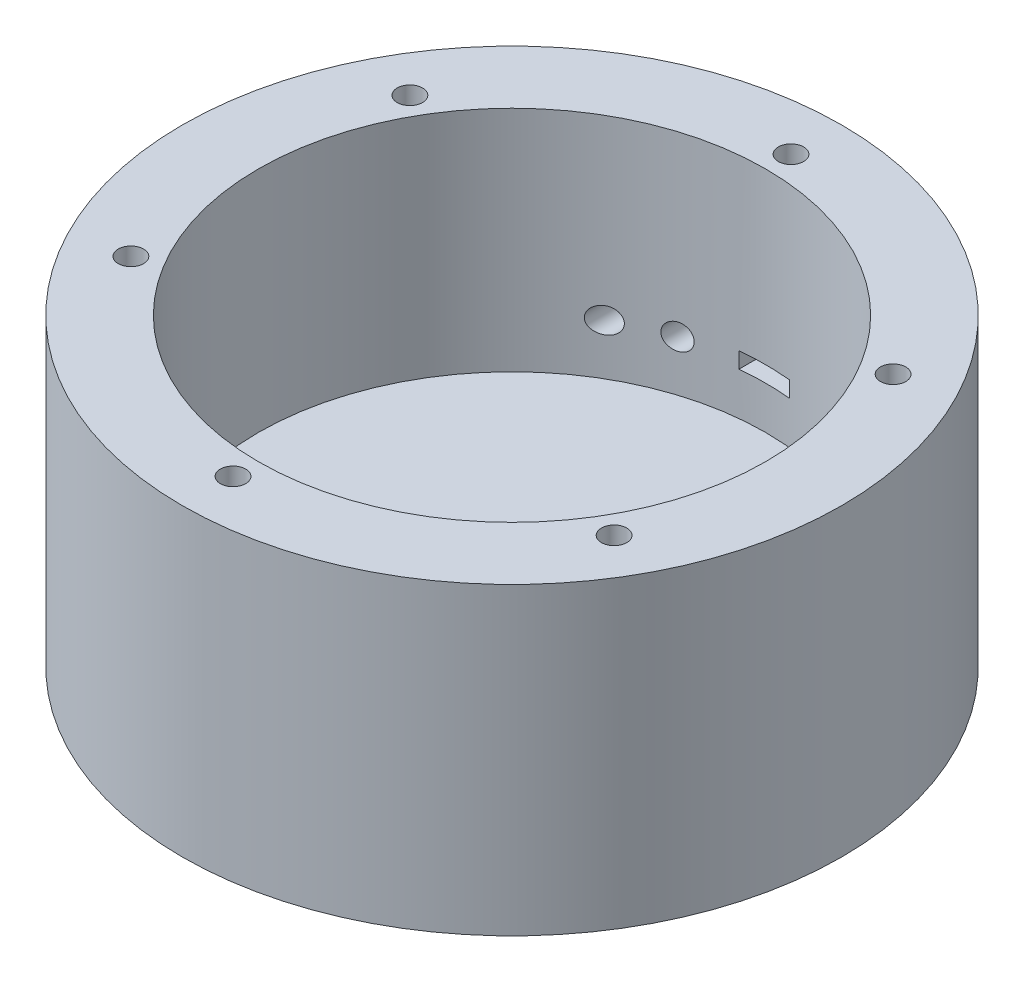
ISO-10303-21;
HEADER;
FILE_DESCRIPTION(('STEP AP214'),'2;1');
FILE_NAME('part.step','',(''),(''),'','','');
FILE_SCHEMA(('AUTOMOTIVE_DESIGN { 1 0 10303 214 1 1 1 1 }'));
ENDSEC;
DATA;
#1=APPLICATION_CONTEXT('core data for automotive mechanical design processes');
#2=APPLICATION_PROTOCOL_DEFINITION('international standard','automotive_design',2000,#1);
#3=PRODUCT_CONTEXT('',#1,'mechanical');
#4=PRODUCT('Part','Part','',(#3));
#5=PRODUCT_RELATED_PRODUCT_CATEGORY('part','',(#4));
#6=PRODUCT_DEFINITION_FORMATION('','',#4);
#7=PRODUCT_DEFINITION_CONTEXT('part definition',#1,'design');
#8=PRODUCT_DEFINITION('design','',#6,#7);
#9=PRODUCT_DEFINITION_SHAPE('','',#8);
#10=(LENGTH_UNIT() NAMED_UNIT(*) SI_UNIT(.MILLI.,.METRE.));
#11=(NAMED_UNIT(*) PLANE_ANGLE_UNIT() SI_UNIT($,.RADIAN.));
#12=(NAMED_UNIT(*) SI_UNIT($,.STERADIAN.) SOLID_ANGLE_UNIT());
#13=UNCERTAINTY_MEASURE_WITH_UNIT(LENGTH_MEASURE(1.E-05),#10,'distance_accuracy_value','');
#14=(GEOMETRIC_REPRESENTATION_CONTEXT(3) GLOBAL_UNCERTAINTY_ASSIGNED_CONTEXT((#13)) GLOBAL_UNIT_ASSIGNED_CONTEXT((#10,
#11,#12)) REPRESENTATION_CONTEXT('',''));
#15=CARTESIAN_POINT('',(0.,0.,0.));
#16=DIRECTION('',(0.,0.,1.));
#17=DIRECTION('',(1.,0.,0.));
#18=AXIS2_PLACEMENT_3D('',#15,#16,#17);
#19=CARTESIAN_POINT('',(0.,60.,0.));
#20=DIRECTION('',(0.,-1.,0.));
#21=DIRECTION('',(0.,0.,-1.));
#22=AXIS2_PLACEMENT_3D('',#19,#20,#21);
#23=CYLINDRICAL_SURFACE('',#22,65.);
#24=CARTESIAN_POINT('',(-17.5,25.,-62.5999201277446));
#25=CARTESIAN_POINT('',(-17.499993314858,25.1367464279968,-62.5999224086799));
#26=CARTESIAN_POINT('',(-17.4887353876538,25.2735940417701,-62.6030725698617));
#27=CARTESIAN_POINT('',(-17.4440582235098,25.5434416207158,-62.6155359942529));
#28=CARTESIAN_POINT('',(-17.4106120390527,25.6764367017729,-62.6248567515891));
#29=CARTESIAN_POINT('',(-17.3227499052347,25.9345520487879,-62.6492170549537));
#30=CARTESIAN_POINT('',(-17.2683618840286,26.0596825455677,-62.6642489841774));
#31=CARTESIAN_POINT('',(-17.1403996056606,26.2988810268148,-62.6993706698294));
#32=CARTESIAN_POINT('',(-17.066828482959,26.4129508143948,-62.7194595999407));
#33=CARTESIAN_POINT('',(-16.9013068204555,26.6290727997728,-62.7642675738807));
#34=CARTESIAN_POINT('',(-16.8090592197218,26.7308818270655,-62.7890609836297));
#35=CARTESIAN_POINT('',(-16.6097162177547,26.9176760402741,-62.8420874162249));
#36=CARTESIAN_POINT('',(-16.5026180320258,27.0026580638425,-62.8703210840012));
#37=CARTESIAN_POINT('',(-16.2726547974634,27.1564141723815,-62.9302413354326));
#38=CARTESIAN_POINT('',(-16.1493773662181,27.2245386512495,-62.9620127008078));
#39=CARTESIAN_POINT('',(-15.8934954203745,27.3390860901144,-63.0270912073561));
#40=CARTESIAN_POINT('',(-15.7608894780387,27.3855057198136,-63.0603985833472));
#41=CARTESIAN_POINT('',(-15.4863976670407,27.4564244275458,-63.1283768999167));
#42=CARTESIAN_POINT('',(-15.3443606866397,27.4803274805523,-63.1630608559211));
#43=CARTESIAN_POINT('',(-15.0581585989178,27.5034440054863,-63.2319027347674));
#44=CARTESIAN_POINT('',(-14.913993369382,27.5026560539756,-63.2660606271681));
#45=CARTESIAN_POINT('',(-14.62669382146,27.4762025004432,-63.3331013017828));
#46=CARTESIAN_POINT('',(-14.4835715036732,27.4503820947573,-63.3659748247911));
#47=CARTESIAN_POINT('',(-14.2034717240476,27.374153583892,-63.4293466616576));
#48=CARTESIAN_POINT('',(-14.0664939561405,27.3237467048853,-63.459845093878));
#49=CARTESIAN_POINT('',(-13.8045199374126,27.200346746593,-63.5173441445694));
#50=CARTESIAN_POINT('',(-13.6793939315734,27.1276477526445,-63.5443841646377));
#51=CARTESIAN_POINT('',(-13.4430705104473,26.9613361204313,-63.5947991055071));
#52=CARTESIAN_POINT('',(-13.3318714516091,26.8677259535788,-63.6181744588661));
#53=CARTESIAN_POINT('',(-13.1292414080212,26.6644529628372,-63.6602978379346));
#54=CARTESIAN_POINT('',(-13.0374287894601,26.5551893597367,-63.6791364858277));
#55=CARTESIAN_POINT('',(-12.8734800404906,26.3221937229816,-63.7124833469877));
#56=CARTESIAN_POINT('',(-12.80134153141,26.1984634409884,-63.7269920837769));
#57=CARTESIAN_POINT('',(-12.6803850843351,25.9428479347317,-63.75116922067));
#58=CARTESIAN_POINT('',(-12.6311106568159,25.8111875896027,-63.7609325714426));
#59=CARTESIAN_POINT('',(-12.5552680172877,25.5412360613601,-63.7759104556576));
#60=CARTESIAN_POINT('',(-12.5286978554998,25.4029454487129,-63.781125379707));
#61=CARTESIAN_POINT('',(-12.4993219776945,25.1256533574926,-63.7868887272983));
#62=CARTESIAN_POINT('',(-12.4962018202791,24.9866863834472,-63.7874988965156));
#63=CARTESIAN_POINT('',(-12.5129938885987,24.7102088032505,-63.7842069399733));
#64=CARTESIAN_POINT('',(-12.5329052596695,24.5726981432488,-63.7803049816518));
#65=CARTESIAN_POINT('',(-12.5950143820306,24.3035433314342,-63.7680688009364));
#66=CARTESIAN_POINT('',(-12.6371311772046,24.1718797408406,-63.7597506781488));
#67=CARTESIAN_POINT('',(-12.7422872207827,23.9175638849119,-63.7388184189517));
#68=CARTESIAN_POINT('',(-12.8053267576911,23.7949117438646,-63.7262042233035));
#69=CARTESIAN_POINT('',(-12.9508652383671,23.561209589623,-63.6967865350772));
#70=CARTESIAN_POINT('',(-13.0334866894092,23.450239241838,-63.6799566290872));
#71=CARTESIAN_POINT('',(-13.2154661114019,23.243759410615,-63.6424391890683));
#72=CARTESIAN_POINT('',(-13.3148251537556,23.1482509176858,-63.6217514080807));
#73=CARTESIAN_POINT('',(-13.5290197453118,22.9737741643163,-63.576550440342));
#74=CARTESIAN_POINT('',(-13.6440715237284,22.8950855606968,-63.5519828749778));
#75=CARTESIAN_POINT('',(-13.8850828299279,22.7580855039489,-63.4997611530994));
#76=CARTESIAN_POINT('',(-14.0110434845389,22.6997761590281,-63.4721066776387));
#77=CARTESIAN_POINT('',(-14.2731470075096,22.6038415645402,-63.4136867569939));
#78=CARTESIAN_POINT('',(-14.4094507573067,22.5666888980231,-63.3828671329299));
#79=CARTESIAN_POINT('',(-14.6859446497359,22.5158228679223,-63.3193742288903));
#80=CARTESIAN_POINT('',(-14.8261352718549,22.5021124093751,-63.2867007196933));
#81=CARTESIAN_POINT('',(-15.1095281942455,22.498300680273,-63.2196471902897));
#82=CARTESIAN_POINT('',(-15.252732275396,22.5086982060483,-63.1852457849412));
#83=CARTESIAN_POINT('',(-15.5352560193932,22.5537847612695,-63.1163764404387));
#84=CARTESIAN_POINT('',(-15.6745753286443,22.5884759944951,-63.0819084955315));
#85=CARTESIAN_POINT('',(-15.9468362977598,22.6817220663563,-63.0136359495751));
#86=CARTESIAN_POINT('',(-16.0796993582857,22.7405143208077,-62.9798415603978));
#87=CARTESIAN_POINT('',(-16.3336663706081,22.8804828407693,-62.9144542680086));
#88=CARTESIAN_POINT('',(-16.4547709216835,22.9616579647138,-62.8828612526257));
#89=CARTESIAN_POINT('',(-16.680423364227,23.1434018733708,-62.8233792467744));
#90=CARTESIAN_POINT('',(-16.7851236228633,23.2437702216445,-62.795456612079));
#91=CARTESIAN_POINT('',(-16.9760812204051,23.4617892909712,-62.744103079428));
#92=CARTESIAN_POINT('',(-17.0623368461159,23.5794416157029,-62.7206725987383));
#93=CARTESIAN_POINT('',(-17.2112397395324,23.8250699969302,-62.6799731404891));
#94=CARTESIAN_POINT('',(-17.2744946037799,23.9526518599176,-62.6625463472538));
#95=CARTESIAN_POINT('',(-17.3785156762233,24.217185447207,-62.6337779352409));
#96=CARTESIAN_POINT('',(-17.4193157130301,24.3541227255708,-62.6224271635353));
#97=CARTESIAN_POINT('',(-17.4653821175079,24.5767650231502,-62.6095896728732));
#98=CARTESIAN_POINT('',(-17.4783441850619,24.660833265553,-62.6059706886278));
#99=CARTESIAN_POINT('',(-17.4956551202179,24.82992130135,-62.6011352304451));
#100=CARTESIAN_POINT('',(-17.5000041582877,24.9149410758783,-62.5999187089586));
#101=CARTESIAN_POINT('',(-17.5,25.,-62.5999201277446));
#102=B_SPLINE_CURVE_WITH_KNOTS('',3,(#24,#25,#26,#27,#28,#29,#30,#31,#32,#33,#34,#35,#36,#37,
#38,#39,#40,#41,#42,#43,#44,#45,#46,#47,#48,#49,#50,#51,#52,#53,#54,#55,#56,#57,#58,#59,#60,#61,
#62,#63,#64,#65,#66,#67,#68,#69,#70,#71,#72,#73,#74,#75,#76,#77,#78,#79,#80,#81,#82,#83,#84,#85,
#86,#87,#88,#89,#90,#91,#92,#93,#94,#95,#96,#97,#98,#99,#100,#101),.UNSPECIFIED.,.T.,.F.,(4,2,2,
2,2,2,2,2,2,2,2,2,2,2,2,2,2,2,2,2,2,2,2,2,2,2,2,2,2,2,2,2,2,2,2,2,2,2,4),(0.,0.409922010859975,
0.820342783413297,1.23021810162831,1.64002648938738,2.05695345882103,2.47395870833491,
2.90514776845897,3.33640296666659,3.77877702940138,4.221176595081,4.66632957900303,
5.11146036459265,5.55095458102224,5.9903968827547,6.42015500852093,6.84986115189347,
7.2705737293989,7.69125017365085,8.10627552406072,8.52128547401754,8.93479274579289,
9.34830571966879,9.76447735250312,10.1806756353547,10.6033321898128,11.0260324546032,
11.4578375693138,11.8896961908738,12.3305695036974,12.7714828150918,13.2168480613646,
13.6621905974261,14.1031139961282,14.5440783313901,14.9723613497182,15.3999973731972,
15.6549818422014,15.9099612645405),.UNSPECIFIED.);
#103=CARTESIAN_POINT('',(-17.5,25.,-62.5999201277446));
#104=VERTEX_POINT('',#103);
#105=EDGE_CURVE('E151',#104,#104,#102,.T.);
#106=ORIENTED_EDGE('',*,*,#105,.F.);
#107=EDGE_LOOP('',(#106));
#108=FACE_BOUND('',#107,.T.);
#109=CARTESIAN_POINT('',(-27.5,25.,-58.8960949469487));
#110=CARTESIAN_POINT('',(-27.4999907890737,25.1309994512943,-58.896099715015));
#111=CARTESIAN_POINT('',(-27.489649876508,25.2621156474305,-58.900931110869));
#112=CARTESIAN_POINT('',(-27.4487151747975,25.5205405573142,-58.9200179849836));
#113=CARTESIAN_POINT('',(-27.4180938623547,25.6478438506793,-58.934286270368));
#114=CARTESIAN_POINT('',(-27.3380283226811,25.8946547382601,-58.9714688196742));
#115=CARTESIAN_POINT('',(-27.2886330424601,26.0141816657076,-58.9943605992776));
#116=CARTESIAN_POINT('',(-27.1729597022722,26.2428496096841,-59.04772899469));
#117=CARTESIAN_POINT('',(-27.1066830477088,26.3519914897479,-59.078204979096));
#118=CARTESIAN_POINT('',(-26.9565059449604,26.5618584527899,-59.1468837503024));
#119=CARTESIAN_POINT('',(-26.8719995055264,26.662062313651,-59.1853498867618));
#120=CARTESIAN_POINT('',(-26.6897920927559,26.8470174263077,-59.2677399031889));
#121=CARTESIAN_POINT('',(-26.5920865715469,26.9317633281534,-59.3116656639046));
#122=CARTESIAN_POINT('',(-26.376970857208,27.091273526144,-59.4076632147344));
#123=CARTESIAN_POINT('',(-26.2585821560656,27.1644917477425,-59.4601118752509));
#124=CARTESIAN_POINT('',(-26.0125050612065,27.2899625246458,-59.5681765318963));
#125=CARTESIAN_POINT('',(-25.8848130472186,27.3422068661792,-59.623793759179));
#126=CARTESIAN_POINT('',(-25.6131949876269,27.4281265941117,-59.7410054165168));
#127=CARTESIAN_POINT('',(-25.4687751615848,27.4600690354321,-59.8027309773184));
#128=CARTESIAN_POINT('',(-25.176606162339,27.4981043128638,-59.926318758166));
#129=CARTESIAN_POINT('',(-25.0288561680837,27.5041907025162,-59.9881810084453));
#130=CARTESIAN_POINT('',(-24.7290991017436,27.4899495767952,-60.1123848236911));
#131=CARTESIAN_POINT('',(-24.5771109485546,27.468751135862,-60.1746758227044));
#132=CARTESIAN_POINT('',(-24.2782766569341,27.398472145143,-60.2958645675404));
#133=CARTESIAN_POINT('',(-24.1314303227923,27.3493926578049,-60.3547624425688));
#134=CARTESIAN_POINT('',(-23.8509026929605,27.2254332808902,-60.4661617771652));
#135=CARTESIAN_POINT('',(-23.7169984365141,27.1511634146647,-60.5187779615029));
#136=CARTESIAN_POINT('',(-23.4634413607848,26.9780108710463,-60.617534102788));
#137=CARTESIAN_POINT('',(-23.3437833382192,26.8791372209437,-60.6636764253491));
#138=CARTESIAN_POINT('',(-23.1303400717695,26.6660406480375,-60.7453673098403));
#139=CARTESIAN_POINT('',(-23.035411229157,26.5531480800812,-60.7813950718633));
#140=CARTESIAN_POINT('',(-22.8661045179433,26.3108398485825,-60.8452913589743));
#141=CARTESIAN_POINT('',(-22.791717080824,26.181431919377,-60.8731636833586));
#142=CARTESIAN_POINT('',(-22.6710886733865,25.9195140094085,-60.9181878614078));
#143=CARTESIAN_POINT('',(-22.6232529254783,25.7878422192372,-60.9359493532038));
#144=CARTESIAN_POINT('',(-22.5501595290296,25.5175514678493,-60.9630367265632));
#145=CARTESIAN_POINT('',(-22.5248943696231,25.3789348339126,-60.9723654143422));
#146=CARTESIAN_POINT('',(-22.4986632998096,25.1059019163974,-60.9820492485992));
#147=CARTESIAN_POINT('',(-22.4965828158226,24.9716060746923,-60.9828160028727));
#148=CARTESIAN_POINT('',(-22.5139117152766,24.7046113172055,-60.9764205564116));
#149=CARTESIAN_POINT('',(-22.5333184537729,24.5719122069085,-60.9692593315622));
#150=CARTESIAN_POINT('',(-22.5924687053025,24.3136139306352,-60.9473651864534));
#151=CARTESIAN_POINT('',(-22.631946832036,24.1879452909393,-60.932731062945));
#152=CARTESIAN_POINT('',(-22.7296311892293,23.9452281108457,-60.8963592211504));
#153=CARTESIAN_POINT('',(-22.7878386538851,23.8281801391438,-60.8746210347306));
#154=CARTESIAN_POINT('',(-22.9225339980305,23.6029472386884,-60.8240306991548));
#155=CARTESIAN_POINT('',(-22.999419909981,23.4950357745828,-60.7950231464217));
#156=CARTESIAN_POINT('',(-23.1681277687524,23.2936857868583,-60.7309310417238));
#157=CARTESIAN_POINT('',(-23.2599527789354,23.2002502393109,-60.6958452432783));
#158=CARTESIAN_POINT('',(-23.4608824090457,23.0252135222055,-60.618472076166));
#159=CARTESIAN_POINT('',(-23.5706392518525,22.9444859279593,-60.575904188282));
#160=CARTESIAN_POINT('',(-23.8003176173764,22.8024995851819,-60.4860322132899));
#161=CARTESIAN_POINT('',(-23.9202420522245,22.7412464384094,-60.4387267685759));
#162=CARTESIAN_POINT('',(-24.1752612551461,22.6356625457488,-60.3371923363499));
#163=CARTESIAN_POINT('',(-24.3108344907583,22.5927287776951,-60.282712110596));
#164=CARTESIAN_POINT('',(-24.5861744072315,22.5304473953661,-60.1709408885666));
#165=CARTESIAN_POINT('',(-24.7259423973041,22.511107224926,-60.113649011136));
#166=CARTESIAN_POINT('',(-25.0145009059552,22.4956273946935,-59.9941707927742));
#167=CARTESIAN_POINT('',(-25.1633337320719,22.5009356929725,-59.9318959879167));
#168=CARTESIAN_POINT('',(-25.4577736115716,22.5377917210042,-59.8074187391793));
#169=CARTESIAN_POINT('',(-25.603379871836,22.5693458303431,-59.745216316575));
#170=CARTESIAN_POINT('',(-25.8910927038415,22.6592218837488,-59.6211077015268));
#171=CARTESIAN_POINT('',(-26.0330131102393,22.718211038734,-59.5592502227738));
#172=CARTESIAN_POINT('',(-26.305003062212,22.8620966215096,-59.4396239867438));
#173=CARTESIAN_POINT('',(-26.4350733545068,22.9469914154209,-59.3818549718889));
#174=CARTESIAN_POINT('',(-26.6751464319191,23.1380940464186,-59.2743904130279));
#175=CARTESIAN_POINT('',(-26.7856392119777,23.2435751872659,-59.2245027676234));
#176=CARTESIAN_POINT('',(-26.9869397036902,23.4750153090219,-59.1330477170969));
#177=CARTESIAN_POINT('',(-27.0777529331342,23.6009685325506,-59.0914779800351));
#178=CARTESIAN_POINT('',(-27.2290019660512,23.8589464951977,-59.0219269036418));
#179=CARTESIAN_POINT('',(-27.2913136350654,23.9896341276493,-58.9931127789731));
#180=CARTESIAN_POINT('',(-27.367362326039,24.193239161681,-58.9578514190004));
#181=CARTESIAN_POINT('',(-27.3898025761156,24.2623370166523,-58.9474271697062));
#182=CARTESIAN_POINT('',(-27.4286492746677,24.402551838136,-58.929361625553));
#183=CARTESIAN_POINT('',(-27.4450583647373,24.4736679059517,-58.9217191123328));
#184=CARTESIAN_POINT('',(-27.472153462403,24.6202214452103,-58.9090911442116));
#185=CARTESIAN_POINT('',(-27.4825809617261,24.6957173244111,-58.9042257468078));
#186=CARTESIAN_POINT('',(-27.4965068192077,24.8474622849668,-58.8977263033463));
#187=CARTESIAN_POINT('',(-27.5000053640619,24.9237113459723,-58.8960921702245));
#188=CARTESIAN_POINT('',(-27.5,25.,-58.8960949469487));
#189=B_SPLINE_CURVE_WITH_KNOTS('',3,(#109,#110,#111,#112,#113,#114,#115,#116,#117,#118,#119,
#120,#121,#122,#123,#124,#125,#126,#127,#128,#129,#130,#131,#132,#133,#134,#135,#136,#137,#138,
#139,#140,#141,#142,#143,#144,#145,#146,#147,#148,#149,#150,#151,#152,#153,#154,#155,#156,#157,
#158,#159,#160,#161,#162,#163,#164,#165,#166,#167,#168,#169,#170,#171,#172,#173,#174,#175,#176,
#177,#178,#179,#180,#181,#182,#183,#184,#185,#186,#187,#188),.UNSPECIFIED.,.T.,.F.,(4,2,2,2,2,2,
2,2,2,2,2,2,2,2,2,2,2,2,2,2,2,2,2,2,2,2,2,2,2,2,2,2,2,2,2,2,2,2,2,4),(0.,0.392714171353446,
0.785962405093925,1.17819232790975,1.57038960757371,1.97850090388371,2.3867531793014,
2.83111864154527,3.27565795641693,3.75431615212259,4.23309368040703,4.72753942556967,
5.22196633042541,5.70518625571792,6.18822914518423,6.64134735504798,7.09425413771739,
7.5157370807432,7.9370797136276,8.33807418261356,8.73901929713873,9.1347958287948,
9.53059844604169,9.93571739325245,10.3409195177623,10.7672961580763,11.1937953334545,
11.6486696575083,12.1036874583871,12.5857620219552,13.0679537979532,13.5625401795232,
14.0570953737748,14.5366100500022,15.015990104531,15.456198694819,15.6761054106141,
15.8959156941402,16.1246223225126,16.3533227884624),.UNSPECIFIED.);
#190=CARTESIAN_POINT('',(-27.5,25.,-58.8960949469487));
#191=VERTEX_POINT('',#190);
#192=EDGE_CURVE('E101',#191,#191,#189,.T.);
#193=ORIENTED_EDGE('',*,*,#192,.F.);
#194=EDGE_LOOP('',(#193));
#195=FACE_BOUND('',#194,.T.);
#196=CARTESIAN_POINT('',(0.,0.,0.));
#197=DIRECTION('',(0.,1.,0.));
#198=DIRECTION('',(0.,0.,1.));
#199=AXIS2_PLACEMENT_3D('',#196,#197,#198);
#200=CIRCLE('',#199,65.);
#201=CARTESIAN_POINT('',(0.,0.,65.));
#202=VERTEX_POINT('',#201);
#203=EDGE_CURVE('E42',#202,#202,#200,.T.);
#204=ORIENTED_EDGE('',*,*,#203,.T.);
#205=EDGE_LOOP('',(#204));
#206=FACE_BOUND('',#205,.T.);
#207=CARTESIAN_POINT('',(0.,60.,0.));
#208=DIRECTION('',(0.,1.,0.));
#209=DIRECTION('',(0.,0.,1.));
#210=AXIS2_PLACEMENT_3D('',#207,#208,#209);
#211=CIRCLE('',#210,65.);
#212=CARTESIAN_POINT('',(0.,60.,65.));
#213=VERTEX_POINT('',#212);
#214=EDGE_CURVE('E11',#213,#213,#211,.T.);
#215=ORIENTED_EDGE('',*,*,#214,.F.);
#216=EDGE_LOOP('',(#215));
#217=FACE_BOUND('',#216,.T.);
#218=DIRECTION('',(0.,-1.,0.));
#219=VECTOR('',#218,1.);
#220=CARTESIAN_POINT('',(4.99999999999999,60.,-64.8074069840786));
#221=LINE('',#220,#219);
#222=CARTESIAN_POINT('',(5.,26.575,-64.8074069840786));
#223=VERTEX_POINT('',#222);
#224=CARTESIAN_POINT('',(5.,23.425,-64.8074069840786));
#225=VERTEX_POINT('',#224);
#226=EDGE_CURVE('E161',#223,#225,#221,.T.);
#227=ORIENTED_EDGE('',*,*,#226,.F.);
#228=CARTESIAN_POINT('',(0.,26.575,0.));
#229=DIRECTION('',(0.,-1.,0.));
#230=DIRECTION('',(0.,0.,-1.));
#231=AXIS2_PLACEMENT_3D('',#228,#229,#230);
#232=CIRCLE('',#231,65.);
#233=CARTESIAN_POINT('',(-5.,26.575,-64.8074069840786));
#234=VERTEX_POINT('',#233);
#235=EDGE_CURVE('E87',#234,#223,#232,.T.);
#236=ORIENTED_EDGE('',*,*,#235,.F.);
#237=DIRECTION('',(0.,-1.,0.));
#238=VECTOR('',#237,1.);
#239=CARTESIAN_POINT('',(-5.,60.,-64.8074069840786));
#240=LINE('',#239,#238);
#241=CARTESIAN_POINT('',(-5.,23.425,-64.8074069840786));
#242=VERTEX_POINT('',#241);
#243=EDGE_CURVE('E169',#242,#234,#240,.F.);
#244=ORIENTED_EDGE('',*,*,#243,.F.);
#245=CARTESIAN_POINT('',(0.,23.425,0.));
#246=DIRECTION('',(0.,1.,0.));
#247=DIRECTION('',(0.,0.,1.));
#248=AXIS2_PLACEMENT_3D('',#245,#246,#247);
#249=CIRCLE('',#248,65.);
#250=EDGE_CURVE('E163',#225,#242,#249,.T.);
#251=ORIENTED_EDGE('',*,*,#250,.F.);
#252=EDGE_LOOP('',(#227,#236,#244,#251));
#253=FACE_BOUND('',#252,.T.);
#254=ADVANCED_FACE('F38',(#108,#195,#206,#217,#253),#23,.T.);
#255=CARTESIAN_POINT('',(0.,60.,0.));
#256=DIRECTION('',(0.,-1.,0.));
#257=DIRECTION('',(0.,0.,-1.));
#258=AXIS2_PLACEMENT_3D('',#255,#256,#257);
#259=CYLINDRICAL_SURFACE('',#258,50.);
#260=CARTESIAN_POINT('',(-27.5,25.,-41.7582327212252));
#261=CARTESIAN_POINT('',(-27.4999911545485,24.875848217574,-41.7582390791611));
#262=CARTESIAN_POINT('',(-27.4906943946616,24.7516160858831,-41.7643655450134));
#263=CARTESIAN_POINT('',(-27.4540322992077,24.5069811908818,-41.7884740744841));
#264=CARTESIAN_POINT('',(-27.4266484444963,24.3865824851463,-41.8064682893107));
#265=CARTESIAN_POINT('',(-27.3554712049721,24.1535093426317,-41.8530760967971));
#266=CARTESIAN_POINT('',(-27.3117439006117,24.0408059334524,-41.8816469213259));
#267=CARTESIAN_POINT('',(-27.2099162651872,23.8250456768831,-41.9478739693569));
#268=CARTESIAN_POINT('',(-27.1518141411082,23.7219900351004,-41.9855313262354));
#269=CARTESIAN_POINT('',(-27.0191805588944,23.5206810373714,-42.0710172359849));
#270=CARTESIAN_POINT('',(-26.9438171345694,23.423195063311,-42.1193534815405));
#271=CARTESIAN_POINT('',(-26.7817708100359,23.2421393638805,-42.2225767786421));
#272=CARTESIAN_POINT('',(-26.6950830722599,23.1585756207785,-42.2774666289173));
#273=CARTESIAN_POINT('',(-26.4982553824649,22.993965689717,-42.4011553539593));
#274=CARTESIAN_POINT('',(-26.3865719724832,22.9153879321004,-42.4707834044818));
#275=CARTESIAN_POINT('',(-26.154082034143,22.77821249907,-42.6143485317238));
#276=CARTESIAN_POINT('',(-26.0332698998556,22.7196272248124,-42.6882882497622));
#277=CARTESIAN_POINT('',(-25.7674617413985,22.6158553023387,-42.8493327920637));
#278=CARTESIAN_POINT('',(-25.6214741549227,22.5737717133766,-42.9368111251262));
#279=CARTESIAN_POINT('',(-25.3247038293975,22.5165697202087,-43.1125174534883));
#280=CARTESIAN_POINT('',(-25.1739188079074,22.5014643525539,-43.2007457905296));
#281=CARTESIAN_POINT('',(-24.8604181560572,22.4986421615675,-43.3819619002628));
#282=CARTESIAN_POINT('',(-24.6976159103772,22.5129471626136,-43.4748425465781));
#283=CARTESIAN_POINT('',(-24.375521473554,22.5737112361163,-43.6562494200524));
#284=CARTESIAN_POINT('',(-24.2162294850026,22.6201721594386,-43.7447753962465));
#285=CARTESIAN_POINT('',(-23.9114236523133,22.7436286526559,-43.9121069973708));
#286=CARTESIAN_POINT('',(-23.76563874561,22.8196577462833,-43.9911256938877));
#287=CARTESIAN_POINT('',(-23.4886112576183,23.0017232183049,-44.139662664447));
#288=CARTESIAN_POINT('',(-23.3573577622174,23.1077368605119,-44.2091880778973));
#289=CARTESIAN_POINT('',(-23.129254708859,23.3346729640694,-44.3289114190811));
#290=CARTESIAN_POINT('',(-23.0302146663866,23.4527116158971,-44.3803899235378));
#291=CARTESIAN_POINT('',(-22.8540319466403,23.7081733457144,-44.4713737775808));
#292=CARTESIAN_POINT('',(-22.776866547317,23.845576085631,-44.5108915541549));
#293=CARTESIAN_POINT('',(-22.6571467744151,24.1167383611009,-44.5719379281088));
#294=CARTESIAN_POINT('',(-22.6114387880841,24.2487389643421,-44.5951151533431));
#295=CARTESIAN_POINT('',(-22.5425495661561,24.5199320060226,-44.6299784908514));
#296=CARTESIAN_POINT('',(-22.5193538608316,24.6591197642503,-44.6416719843303));
#297=CARTESIAN_POINT('',(-22.4977389411324,24.927622562959,-44.6525683652841));
#298=CARTESIAN_POINT('',(-22.4973383966529,25.0567420876764,-44.6527701048254));
#299=CARTESIAN_POINT('',(-22.5163599772822,25.313117477678,-44.6431814202939));
#300=CARTESIAN_POINT('',(-22.5357782070928,25.4403737042004,-44.6333929597537));
#301=CARTESIAN_POINT('',(-22.5929127514711,25.6867265304392,-44.6044983962018));
#302=CARTESIAN_POINT('',(-22.6302377796961,25.8059381351457,-44.5855914981295));
#303=CARTESIAN_POINT('',(-22.7214212030059,26.036051492576,-44.5391919660876));
#304=CARTESIAN_POINT('',(-22.7752815863182,26.1469522439985,-44.5116982996295));
#305=CARTESIAN_POINT('',(-22.9000689755004,26.3625166396028,-44.447631496911));
#306=CARTESIAN_POINT('',(-22.9716231074888,26.4667160452138,-44.4107226403287));
#307=CARTESIAN_POINT('',(-23.1278391210496,26.6615111050821,-44.329570249903));
#308=CARTESIAN_POINT('',(-23.212505200284,26.7521023844698,-44.2853243668601));
#309=CARTESIAN_POINT('',(-23.4004167500866,26.9259166115865,-44.1863410766657));
#310=CARTESIAN_POINT('',(-23.504649512743,27.0077358854046,-44.131017109426));
#311=CARTESIAN_POINT('',(-23.7222754952261,27.1527995497356,-44.0144169998166));
#312=CARTESIAN_POINT('',(-23.8356726836315,27.2160358374899,-43.9531382764389));
#313=CARTESIAN_POINT('',(-24.0821559454524,27.3298173217904,-43.818622134751));
#314=CARTESIAN_POINT('',(-24.2160023969882,27.3780491684891,-43.7448212789572));
#315=CARTESIAN_POINT('',(-24.4877828591465,27.4510115433402,-43.5932649249587));
#316=CARTESIAN_POINT('',(-24.6257186891854,27.4757314438807,-43.5155076551322));
#317=CARTESIAN_POINT('',(-24.917563897463,27.5033885856471,-43.3491194394781));
#318=CARTESIAN_POINT('',(-25.0715790019932,27.5036644362834,-43.2602256214956));
#319=CARTESIAN_POINT('',(-25.376846219412,27.4761864496782,-43.0818637251318));
#320=CARTESIAN_POINT('',(-25.5280964191818,27.4484139006134,-42.9923953030082));
#321=CARTESIAN_POINT('',(-25.8325621626274,27.3628943778246,-42.8101853459504));
#322=CARTESIAN_POINT('',(-25.9853876567836,27.3035105257329,-42.7175527705121));
#323=CARTESIAN_POINT('',(-26.2789004501168,27.1544037220875,-42.5376182676991));
#324=CARTESIAN_POINT('',(-26.4195978938912,27.0647064416437,-42.4503119033998));
#325=CARTESIAN_POINT('',(-26.6580666971106,26.8759807154773,-42.3008673099819));
#326=CARTESIAN_POINT('',(-26.7588895132546,26.7820649174782,-42.2371180297343));
#327=CARTESIAN_POINT('',(-26.9458670187384,26.5757288615299,-42.1180781702765));
#328=CARTESIAN_POINT('',(-27.0320237636101,26.4633112010715,-42.0627864058085));
#329=CARTESIAN_POINT('',(-27.1475887453168,26.2818318854899,-41.9882194947421));
#330=CARTESIAN_POINT('',(-27.1839762990117,26.2188556637832,-41.9646644054514));
#331=CARTESIAN_POINT('',(-27.2515001560755,26.0890760135432,-41.9208462809348));
#332=CARTESIAN_POINT('',(-27.2826394213759,26.0222747724169,-41.9005813890869));
#333=CARTESIAN_POINT('',(-27.3391230545147,25.8854232200195,-41.8637491103359));
#334=CARTESIAN_POINT('',(-27.3644772273934,25.8153786519349,-41.8471754683625));
#335=CARTESIAN_POINT('',(-27.408989482383,25.6725781924855,-41.8180344136323));
#336=CARTESIAN_POINT('',(-27.4281507378238,25.599823711098,-41.8054649491314));
#337=CARTESIAN_POINT('',(-27.4624976606639,25.4402276917947,-41.7829118188667));
#338=CARTESIAN_POINT('',(-27.4765250740156,25.3530240501485,-41.7736843403162));
#339=CARTESIAN_POINT('',(-27.4952787916505,25.1772271339598,-41.7613429225902));
#340=CARTESIAN_POINT('',(-27.5000063149164,25.0886340430739,-41.7582281821879));
#341=CARTESIAN_POINT('',(-27.5,25.,-41.7582327212252));
#342=B_SPLINE_CURVE_WITH_KNOTS('',3,(#260,#261,#262,#263,#264,#265,#266,#267,#268,#269,#270,
#271,#272,#273,#274,#275,#276,#277,#278,#279,#280,#281,#282,#283,#284,#285,#286,#287,#288,#289,
#290,#291,#292,#293,#294,#295,#296,#297,#298,#299,#300,#301,#302,#303,#304,#305,#306,#307,#308,
#309,#310,#311,#312,#313,#314,#315,#316,#317,#318,#319,#320,#321,#322,#323,#324,#325,#326,#327,
#328,#329,#330,#331,#332,#333,#334,#335,#336,#337,#338,#339,#340,#341),.UNSPECIFIED.,.T.,.F.,(4,
2,2,2,2,2,2,2,2,2,2,2,2,2,2,2,2,2,2,2,2,2,2,2,2,2,2,2,2,2,2,2,2,2,2,2,2,2,2,2,4),(0.,
0.372111327071438,0.744604246002527,1.11560709939297,1.48665625244659,1.88222529095028,
2.27796386627562,2.73601771292446,3.19435517195823,3.71806826218048,4.24203435525836,
4.80322140661286,5.36444076206806,5.90867837548844,6.45250441470721,6.93706485714206,
7.42112010770818,7.8436159986315,8.2658401508987,8.65130344580859,9.03669099408622,
9.41401639434352,9.79138718236292,10.1847684369248,10.5782758899928,11.0073108323016,
11.4365325705267,11.915391362653,12.3944665005545,12.9256441455453,13.4571763873122,
14.0193744045266,14.581097509046,15.0347843069727,15.4884074657059,15.7174770200862,
15.9464168603921,16.1749657440197,16.4033973299246,16.6690886851432,16.9347452125604),.UNSPECIFIED.);
#343=CARTESIAN_POINT('',(-27.5,25.,-41.7582327212252));
#344=VERTEX_POINT('',#343);
#345=EDGE_CURVE('E117',#344,#344,#342,.T.);
#346=ORIENTED_EDGE('',*,*,#345,.F.);
#347=EDGE_LOOP('',(#346));
#348=FACE_BOUND('',#347,.T.);
#349=CARTESIAN_POINT('',(0.,60.,0.));
#350=DIRECTION('',(0.,1.,0.));
#351=DIRECTION('',(0.,0.,1.));
#352=AXIS2_PLACEMENT_3D('',#349,#350,#351);
#353=CIRCLE('',#352,50.);
#354=CARTESIAN_POINT('',(0.,60.,50.));
#355=VERTEX_POINT('',#354);
#356=EDGE_CURVE('E208',#355,#355,#353,.T.);
#357=ORIENTED_EDGE('',*,*,#356,.T.);
#358=EDGE_LOOP('',(#357));
#359=FACE_BOUND('',#358,.T.);
#360=CARTESIAN_POINT('',(0.,15.,0.));
#361=DIRECTION('',(0.,1.,0.));
#362=DIRECTION('',(0.,0.,1.));
#363=AXIS2_PLACEMENT_3D('',#360,#361,#362);
#364=CIRCLE('',#363,50.);
#365=CARTESIAN_POINT('',(0.,15.,50.));
#366=VERTEX_POINT('',#365);
#367=EDGE_CURVE('E176',#366,#366,#364,.T.);
#368=ORIENTED_EDGE('',*,*,#367,.F.);
#369=EDGE_LOOP('',(#368));
#370=FACE_BOUND('',#369,.T.);
#371=CARTESIAN_POINT('',(-17.5,25.,-46.837484987988));
#372=CARTESIAN_POINT('',(-17.4999929909083,24.8658520012613,-46.837488147224));
#373=CARTESIAN_POINT('',(-17.4891542055582,24.7316015677834,-46.8415417604053));
#374=CARTESIAN_POINT('',(-17.4461932823431,24.466933982605,-46.8575590686791));
#375=CARTESIAN_POINT('',(-17.4140445471635,24.336521834246,-46.8695326487789));
#376=CARTESIAN_POINT('',(-17.3297724751222,24.0835414126219,-46.9007567758997));
#377=CARTESIAN_POINT('',(-17.2776879066952,23.9609584507702,-46.919993198175));
#378=CARTESIAN_POINT('',(-17.1554010110584,23.7265271935601,-46.9648425719723));
#379=CARTESIAN_POINT('',(-17.0852007116782,23.6146776986454,-46.9904548097899));
#380=CARTESIAN_POINT('',(-16.9266406379532,23.4011736101523,-47.0478068320271));
#381=CARTESIAN_POINT('',(-16.8378128043423,23.2999092943954,-47.0797029312412));
#382=CARTESIAN_POINT('',(-16.6459912093332,23.1135729514194,-47.1478666478228));
#383=CARTESIAN_POINT('',(-16.5429936154995,23.0285053197391,-47.1841354475269));
#384=CARTESIAN_POINT('',(-16.3192024669548,22.8717515716024,-47.2620191117762));
#385=CARTESIAN_POINT('',(-16.1977194221206,22.8011431048784,-47.3038227744298));
#386=CARTESIAN_POINT('',(-15.9452763904766,22.6813831593722,-47.3895128949458));
#387=CARTESIAN_POINT('',(-15.8143139471846,22.6322372657543,-47.4333998916598));
#388=CARTESIAN_POINT('',(-15.5401709554582,22.5547169247429,-47.5239395563096));
#389=CARTESIAN_POINT('',(-15.3967056382788,22.527386900756,-47.5706273226579));
#390=CARTESIAN_POINT('',(-15.1070091382977,22.4980506637229,-47.6634179806381));
#391=CARTESIAN_POINT('',(-14.9607776478521,22.4960472841964,-47.7095208062509));
#392=CARTESIAN_POINT('',(-14.667815928848,22.5177657611902,-47.8004077141802));
#393=CARTESIAN_POINT('',(-14.521101623707,22.5418037961012,-47.845168652913));
#394=CARTESIAN_POINT('',(-14.2333823693936,22.6158114734303,-47.9315490309327));
#395=CARTESIAN_POINT('',(-14.0923769494669,22.6657789729927,-47.9731687294918));
#396=CARTESIAN_POINT('',(-13.8234126608565,22.789325333598,-48.0513526084151));
#397=CARTESIAN_POINT('',(-13.695242313342,22.8623874573314,-48.0880044540164));
#398=CARTESIAN_POINT('',(-13.4528913173301,23.0306844671686,-48.1563659807187));
#399=CARTESIAN_POINT('',(-13.3387076809231,23.1259146049812,-48.1880767177587));
#400=CARTESIAN_POINT('',(-13.1323387093421,23.3319789785363,-48.2447170684337));
#401=CARTESIAN_POINT('',(-13.0394825052956,23.4420830641096,-48.2698585136143));
#402=CARTESIAN_POINT('',(-12.8736378110451,23.677393640207,-48.3143544587737));
#403=CARTESIAN_POINT('',(-12.8006449776208,23.8025968205878,-48.3337102239102));
#404=CARTESIAN_POINT('',(-12.6794060358115,24.0596267114211,-48.365653808276));
#405=CARTESIAN_POINT('',(-12.6303579602981,24.1910481356467,-48.3784617557325));
#406=CARTESIAN_POINT('',(-12.5548636247908,24.4606533744539,-48.398108826975));
#407=CARTESIAN_POINT('',(-12.528413942768,24.5988361618243,-48.4049488544743));
#408=CARTESIAN_POINT('',(-12.4993897458401,24.8745955221594,-48.4124516612763));
#409=CARTESIAN_POINT('',(-12.4962754652118,25.0121117586398,-48.4132540965489));
#410=CARTESIAN_POINT('',(-12.512601739136,25.2857023429515,-48.4090370404577));
#411=CARTESIAN_POINT('',(-12.5320408706703,25.4217767812071,-48.4040179164079));
#412=CARTESIAN_POINT('',(-12.5926194578949,25.6877563578182,-48.3882929537243));
#413=CARTESIAN_POINT('',(-12.6336227303398,25.817694697516,-48.3776227998954));
#414=CARTESIAN_POINT('',(-12.735887867944,26.0687219851653,-48.3508007995475));
#415=CARTESIAN_POINT('',(-12.7971502218814,26.1898107195219,-48.3346488207716));
#416=CARTESIAN_POINT('',(-12.9387324536873,26.4211863302689,-48.2969419923264));
#417=CARTESIAN_POINT('',(-13.019252286904,26.5313414537131,-48.275330310908));
#418=CARTESIAN_POINT('',(-13.1964426504946,26.7365378577899,-48.2271947283996));
#419=CARTESIAN_POINT('',(-13.2931148717358,26.8315775540715,-48.2006703130024));
#420=CARTESIAN_POINT('',(-13.502427136224,27.006581031155,-48.1424609164269));
#421=CARTESIAN_POINT('',(-13.6154192075118,27.0860845272892,-48.1106589251978));
#422=CARTESIAN_POINT('',(-13.8520130836817,27.2250755026354,-48.0430730009825));
#423=CARTESIAN_POINT('',(-13.9756166572234,27.2845596369831,-48.0072884039045));
#424=CARTESIAN_POINT('',(-14.2346599226388,27.3841569592803,-47.931130996582));
#425=CARTESIAN_POINT('',(-14.3703671175646,27.4234825449496,-47.8906382811378));
#426=CARTESIAN_POINT('',(-14.645714994792,27.4787522102197,-47.8071515515065));
#427=CARTESIAN_POINT('',(-14.7853564642295,27.4946915765594,-47.764157034921));
#428=CARTESIAN_POINT('',(-15.0699650624974,27.5032173372465,-47.6751420171586));
#429=CARTESIAN_POINT('',(-15.2149418797356,27.4949369100176,-47.6290683190671));
#430=CARTESIAN_POINT('',(-15.5012284692965,27.4535072933284,-47.5366654252541));
#431=CARTESIAN_POINT('',(-15.6425376408895,27.4203540561733,-47.4903361891655));
#432=CARTESIAN_POINT('',(-15.9202812782135,27.3291305988135,-47.3979585028397));
#433=CARTESIAN_POINT('',(-16.0565718145276,27.2705982377892,-47.3519321716617));
#434=CARTESIAN_POINT('',(-16.3173879151367,27.1298920987791,-47.2626900144743));
#435=CARTESIAN_POINT('',(-16.4419138955783,27.0477191574458,-47.2194740890696));
#436=CARTESIAN_POINT('',(-16.6735142373731,26.8630496412705,-47.1381881450143));
#437=CARTESIAN_POINT('',(-16.7808233017031,26.7608779847205,-47.1000503955939));
#438=CARTESIAN_POINT('',(-16.9765436706458,26.5379389905996,-47.0298607649506));
#439=CARTESIAN_POINT('',(-17.0649556933533,26.4171723599451,-46.9978086524763));
#440=CARTESIAN_POINT('',(-17.2155691563017,26.1668478799509,-46.9428408557285));
#441=CARTESIAN_POINT('',(-17.2788535483917,26.0380236743066,-46.9195507163036));
#442=CARTESIAN_POINT('',(-17.3826125616167,25.7704933792991,-46.8812102984818));
#443=CARTESIAN_POINT('',(-17.4231278670764,25.631805417657,-46.8661453245523));
#444=CARTESIAN_POINT('',(-17.4675405230848,25.4099054153064,-46.8496029338922));
#445=CARTESIAN_POINT('',(-17.4796922587905,25.328480140178,-46.8450684009909));
#446=CARTESIAN_POINT('',(-17.4959240314318,25.1647161013071,-46.8390085019766));
#447=CARTESIAN_POINT('',(-17.5000043041305,25.082377364317,-46.83748304797));
#448=CARTESIAN_POINT('',(-17.5,25.,-46.837484987988));
#449=B_SPLINE_CURVE_WITH_KNOTS('',3,(#371,#372,#373,#374,#375,#376,#377,#378,#379,#380,#381,
#382,#383,#384,#385,#386,#387,#388,#389,#390,#391,#392,#393,#394,#395,#396,#397,#398,#399,#400,
#401,#402,#403,#404,#405,#406,#407,#408,#409,#410,#411,#412,#413,#414,#415,#416,#417,#418,#419,
#420,#421,#422,#423,#424,#425,#426,#427,#428,#429,#430,#431,#432,#433,#434,#435,#436,#437,#438,
#439,#440,#441,#442,#443,#444,#445,#446,#447,#448),.UNSPECIFIED.,.T.,.F.,(4,2,2,2,2,2,2,2,2,2,2,
2,2,2,2,2,2,2,2,2,2,2,2,2,2,2,2,2,2,2,2,2,2,2,2,2,2,2,4),(0.,0.402131351909209,
0.804765558319774,1.2066207234633,1.60843092544071,2.02190711471486,2.43549535582417,
2.87334419989798,3.31130691674388,3.76915491468373,4.22705413574933,4.69057583313175,
5.15405923038063,5.60782997423949,6.06150361168855,6.49794396475606,6.93428881124931,
7.35479786376924,7.77524322816397,8.18593243849752,8.59659573760929,9.00469619250161,
9.41280649409591,9.82535384414381,10.2379444076383,10.6613460089327,11.0848183177073,
11.5237708457535,11.9628118281912,12.4177560620402,12.872774347632,13.3364511844613,
13.8001116135426,14.2567851017775,14.7134412331567,15.1474363610149,15.5806535305708,
15.8276008487692,16.0745409536606),.UNSPECIFIED.);
#450=CARTESIAN_POINT('',(-17.5,25.,-46.837484987988));
#451=VERTEX_POINT('',#450);
#452=EDGE_CURVE('E109',#451,#451,#449,.T.);
#453=ORIENTED_EDGE('',*,*,#452,.F.);
#454=EDGE_LOOP('',(#453));
#455=FACE_BOUND('',#454,.T.);
#456=CARTESIAN_POINT('',(0.,26.575,0.));
#457=DIRECTION('',(0.,-1.,0.));
#458=DIRECTION('',(0.,0.,-1.));
#459=AXIS2_PLACEMENT_3D('',#456,#457,#458);
#460=CIRCLE('',#459,50.);
#461=CARTESIAN_POINT('',(5.,26.575,-49.749371855331));
#462=VERTEX_POINT('',#461);
#463=CARTESIAN_POINT('',(-5.,26.575,-49.749371855331));
#464=VERTEX_POINT('',#463);
#465=EDGE_CURVE('E85',#462,#464,#460,.F.);
#466=ORIENTED_EDGE('',*,*,#465,.F.);
#467=DIRECTION('',(0.,-1.,0.));
#468=VECTOR('',#467,1.);
#469=CARTESIAN_POINT('',(4.99999999999999,60.,-49.749371855331));
#470=LINE('',#469,#468);
#471=CARTESIAN_POINT('',(5.,23.425,-49.749371855331));
#472=VERTEX_POINT('',#471);
#473=EDGE_CURVE('E93',#472,#462,#470,.F.);
#474=ORIENTED_EDGE('',*,*,#473,.F.);
#475=CARTESIAN_POINT('',(0.,23.425,0.));
#476=DIRECTION('',(0.,1.,0.));
#477=DIRECTION('',(0.,0.,1.));
#478=AXIS2_PLACEMENT_3D('',#475,#476,#477);
#479=CIRCLE('',#478,50.);
#480=CARTESIAN_POINT('',(-5.,23.425,-49.749371855331));
#481=VERTEX_POINT('',#480);
#482=EDGE_CURVE('E97',#481,#472,#479,.F.);
#483=ORIENTED_EDGE('',*,*,#482,.F.);
#484=DIRECTION('',(0.,-1.,0.));
#485=VECTOR('',#484,1.);
#486=CARTESIAN_POINT('',(-5.,60.,-49.749371855331));
#487=LINE('',#486,#485);
#488=EDGE_CURVE('E61',#464,#481,#487,.T.);
#489=ORIENTED_EDGE('',*,*,#488,.F.);
#490=EDGE_LOOP('',(#466,#474,#483,#489));
#491=FACE_BOUND('',#490,.T.);
#492=ADVANCED_FACE('F99',(#348,#359,#370,#455,#491),#259,.F.);
#493=CARTESIAN_POINT('',(0.,60.,0.));
#494=DIRECTION('',(0.,1.,0.));
#495=DIRECTION('',(0.,0.,1.));
#496=AXIS2_PLACEMENT_3D('',#493,#494,#495);
#497=PLANE('',#496);
#498=CARTESIAN_POINT('',(0.,60.,-55.));
#499=DIRECTION('',(0.,1.,0.));
#500=DIRECTION('',(0.,0.,1.));
#501=AXIS2_PLACEMENT_3D('',#498,#499,#500);
#502=CIRCLE('',#501,2.5);
#503=CARTESIAN_POINT('',(0.,60.,-52.5));
#504=VERTEX_POINT('',#503);
#505=EDGE_CURVE('E177',#504,#504,#502,.T.);
#506=ORIENTED_EDGE('',*,*,#505,.F.);
#507=EDGE_LOOP('',(#506));
#508=FACE_BOUND('',#507,.T.);
#509=CARTESIAN_POINT('',(-47.6313972081426,60.,-27.4999999999973));
#510=DIRECTION('',(0.,1.,0.));
#511=DIRECTION('',(0.,0.,1.));
#512=AXIS2_PLACEMENT_3D('',#509,#510,#511);
#513=CIRCLE('',#512,2.50000000000294);
#514=CARTESIAN_POINT('',(-47.6313972081426,60.,-24.9999999999943));
#515=VERTEX_POINT('',#514);
#516=EDGE_CURVE('E164',#515,#515,#513,.T.);
#517=ORIENTED_EDGE('',*,*,#516,.F.);
#518=EDGE_LOOP('',(#517));
#519=FACE_BOUND('',#518,.T.);
#520=CARTESIAN_POINT('',(-47.6313972081394,60.,27.5000000000027));
#521=DIRECTION('',(0.,1.,0.));
#522=DIRECTION('',(0.,0.,1.));
#523=AXIS2_PLACEMENT_3D('',#520,#521,#522);
#524=CIRCLE('',#523,2.50000000000577);
#525=CARTESIAN_POINT('',(-47.6313972081394,60.,30.0000000000085));
#526=VERTEX_POINT('',#525);
#527=EDGE_CURVE('E182',#526,#526,#524,.T.);
#528=ORIENTED_EDGE('',*,*,#527,.F.);
#529=EDGE_LOOP('',(#528));
#530=FACE_BOUND('',#529,.T.);
#531=CARTESIAN_POINT('',(6.23256940250295E-12,60.,55.));
#532=DIRECTION('',(0.,1.,0.));
#533=DIRECTION('',(0.,0.,1.));
#534=AXIS2_PLACEMENT_3D('',#531,#532,#533);
#535=CIRCLE('',#534,2.50000000000633);
#536=CARTESIAN_POINT('',(6.23256940250295E-12,60.,57.5000000000063));
#537=VERTEX_POINT('',#536);
#538=EDGE_CURVE('E198',#537,#537,#535,.T.);
#539=ORIENTED_EDGE('',*,*,#538,.F.);
#540=EDGE_LOOP('',(#539));
#541=FACE_BOUND('',#540,.T.);
#542=CARTESIAN_POINT('',(47.6313972081488,60.,27.4999999999973));
#543=DIRECTION('',(0.,1.,0.));
#544=DIRECTION('',(0.,0.,1.));
#545=AXIS2_PLACEMENT_3D('',#542,#543,#544);
#546=CIRCLE('',#545,2.50000000000394);
#547=CARTESIAN_POINT('',(47.6313972081488,60.,30.0000000000012));
#548=VERTEX_POINT('',#547);
#549=EDGE_CURVE('E192',#548,#548,#546,.T.);
#550=ORIENTED_EDGE('',*,*,#549,.F.);
#551=EDGE_LOOP('',(#550));
#552=FACE_BOUND('',#551,.T.);
#553=CARTESIAN_POINT('',(47.6313972081457,60.,-27.5000000000027));
#554=DIRECTION('',(0.,1.,0.));
#555=DIRECTION('',(0.,0.,1.));
#556=AXIS2_PLACEMENT_3D('',#553,#554,#555);
#557=CIRCLE('',#556,2.50000000000084);
#558=CARTESIAN_POINT('',(47.6313972081457,60.,-25.0000000000019));
#559=VERTEX_POINT('',#558);
#560=EDGE_CURVE('E186',#559,#559,#557,.T.);
#561=ORIENTED_EDGE('',*,*,#560,.F.);
#562=EDGE_LOOP('',(#561));
#563=FACE_BOUND('',#562,.T.);
#564=ORIENTED_EDGE('',*,*,#356,.F.);
#565=EDGE_LOOP('',(#564));
#566=FACE_BOUND('',#565,.T.);
#567=ORIENTED_EDGE('',*,*,#214,.T.);
#568=EDGE_LOOP('',(#567));
#569=FACE_BOUND('',#568,.T.);
#570=ADVANCED_FACE('F145',(#508,#519,#530,#541,#552,#563,#566,#569),#497,.T.);
#571=CARTESIAN_POINT('',(0.,0.,0.));
#572=DIRECTION('',(0.,1.,0.));
#573=DIRECTION('',(0.,0.,1.));
#574=AXIS2_PLACEMENT_3D('',#571,#572,#573);
#575=PLANE('',#574);
#576=ORIENTED_EDGE('',*,*,#203,.F.);
#577=EDGE_LOOP('',(#576));
#578=FACE_BOUND('',#577,.T.);
#579=ADVANCED_FACE('F216',(#578),#575,.F.);
#580=CARTESIAN_POINT('',(0.,15.,0.));
#581=DIRECTION('',(0.,1.,0.));
#582=DIRECTION('',(0.,0.,1.));
#583=AXIS2_PLACEMENT_3D('',#580,#581,#582);
#584=PLANE('',#583);
#585=ORIENTED_EDGE('',*,*,#367,.T.);
#586=EDGE_LOOP('',(#585));
#587=FACE_BOUND('',#586,.T.);
#588=ADVANCED_FACE('F222',(#587),#584,.T.);
#589=CARTESIAN_POINT('',(47.6313972081457,50.,-27.5000000000027));
#590=DIRECTION('',(0.,1.,0.));
#591=DIRECTION('',(0.,0.,1.));
#592=AXIS2_PLACEMENT_3D('',#589,#590,#591);
#593=CYLINDRICAL_SURFACE('',#592,2.50000000000084);
#594=CARTESIAN_POINT('',(47.6313972081457,50.,-27.5000000000027));
#595=DIRECTION('',(0.,1.,0.));
#596=DIRECTION('',(0.,0.,1.));
#597=AXIS2_PLACEMENT_3D('',#594,#595,#596);
#598=CIRCLE('',#597,2.50000000000084);
#599=CARTESIAN_POINT('',(47.6313972081457,50.,-25.0000000000019));
#600=VERTEX_POINT('',#599);
#601=EDGE_CURVE('E180',#600,#600,#598,.T.);
#602=ORIENTED_EDGE('',*,*,#601,.F.);
#603=EDGE_LOOP('',(#602));
#604=FACE_BOUND('',#603,.T.);
#605=ORIENTED_EDGE('',*,*,#560,.T.);
#606=EDGE_LOOP('',(#605));
#607=FACE_BOUND('',#606,.T.);
#608=ADVANCED_FACE('F228',(#604,#607),#593,.F.);
#609=CARTESIAN_POINT('',(47.6313972081457,50.,-27.5000000000027));
#610=DIRECTION('',(0.,1.,0.));
#611=DIRECTION('',(0.,0.,1.));
#612=AXIS2_PLACEMENT_3D('',#609,#610,#611);
#613=PLANE('',#612);
#614=ORIENTED_EDGE('',*,*,#601,.T.);
#615=EDGE_LOOP('',(#614));
#616=FACE_BOUND('',#615,.T.);
#617=ADVANCED_FACE('F252',(#616),#613,.T.);
#618=CARTESIAN_POINT('',(47.6313972081488,50.,27.4999999999973));
#619=DIRECTION('',(0.,1.,0.));
#620=DIRECTION('',(0.,0.,1.));
#621=AXIS2_PLACEMENT_3D('',#618,#619,#620);
#622=CYLINDRICAL_SURFACE('',#621,2.50000000000394);
#623=CARTESIAN_POINT('',(47.6313972081488,50.,27.4999999999973));
#624=DIRECTION('',(0.,1.,0.));
#625=DIRECTION('',(0.,0.,1.));
#626=AXIS2_PLACEMENT_3D('',#623,#624,#625);
#627=CIRCLE('',#626,2.50000000000394);
#628=CARTESIAN_POINT('',(47.6313972081488,50.,30.0000000000012));
#629=VERTEX_POINT('',#628);
#630=EDGE_CURVE('E189',#629,#629,#627,.T.);
#631=ORIENTED_EDGE('',*,*,#630,.F.);
#632=EDGE_LOOP('',(#631));
#633=FACE_BOUND('',#632,.T.);
#634=ORIENTED_EDGE('',*,*,#549,.T.);
#635=EDGE_LOOP('',(#634));
#636=FACE_BOUND('',#635,.T.);
#637=ADVANCED_FACE('F249',(#633,#636),#622,.F.);
#638=CARTESIAN_POINT('',(47.6313972081488,50.,27.4999999999973));
#639=DIRECTION('',(0.,1.,0.));
#640=DIRECTION('',(0.,0.,1.));
#641=AXIS2_PLACEMENT_3D('',#638,#639,#640);
#642=PLANE('',#641);
#643=ORIENTED_EDGE('',*,*,#630,.T.);
#644=EDGE_LOOP('',(#643));
#645=FACE_BOUND('',#644,.T.);
#646=ADVANCED_FACE('F244',(#645),#642,.T.);
#647=CARTESIAN_POINT('',(6.23256940250295E-12,50.,55.));
#648=DIRECTION('',(0.,1.,0.));
#649=DIRECTION('',(0.,0.,1.));
#650=AXIS2_PLACEMENT_3D('',#647,#648,#649);
#651=CYLINDRICAL_SURFACE('',#650,2.50000000000633);
#652=CARTESIAN_POINT('',(6.23256940250295E-12,50.,55.));
#653=DIRECTION('',(0.,1.,0.));
#654=DIRECTION('',(0.,0.,1.));
#655=AXIS2_PLACEMENT_3D('',#652,#653,#654);
#656=CIRCLE('',#655,2.50000000000633);
#657=CARTESIAN_POINT('',(6.23256940250295E-12,50.,57.5000000000063));
#658=VERTEX_POINT('',#657);
#659=EDGE_CURVE('E195',#658,#658,#656,.T.);
#660=ORIENTED_EDGE('',*,*,#659,.F.);
#661=EDGE_LOOP('',(#660));
#662=FACE_BOUND('',#661,.T.);
#663=ORIENTED_EDGE('',*,*,#538,.T.);
#664=EDGE_LOOP('',(#663));
#665=FACE_BOUND('',#664,.T.);
#666=ADVANCED_FACE('F241',(#662,#665),#651,.F.);
#667=CARTESIAN_POINT('',(6.23256940250295E-12,50.,55.));
#668=DIRECTION('',(0.,1.,0.));
#669=DIRECTION('',(0.,0.,1.));
#670=AXIS2_PLACEMENT_3D('',#667,#668,#669);
#671=PLANE('',#670);
#672=ORIENTED_EDGE('',*,*,#659,.T.);
#673=EDGE_LOOP('',(#672));
#674=FACE_BOUND('',#673,.T.);
#675=ADVANCED_FACE('F235',(#674),#671,.T.);
#676=CARTESIAN_POINT('',(-47.6313972081394,50.,27.5000000000027));
#677=DIRECTION('',(0.,1.,0.));
#678=DIRECTION('',(0.,0.,1.));
#679=AXIS2_PLACEMENT_3D('',#676,#677,#678);
#680=CYLINDRICAL_SURFACE('',#679,2.50000000000577);
#681=CARTESIAN_POINT('',(-47.6313972081394,50.,27.5000000000027));
#682=DIRECTION('',(0.,1.,0.));
#683=DIRECTION('',(0.,0.,1.));
#684=AXIS2_PLACEMENT_3D('',#681,#682,#683);
#685=CIRCLE('',#684,2.50000000000577);
#686=CARTESIAN_POINT('',(-47.6313972081394,50.,30.0000000000085));
#687=VERTEX_POINT('',#686);
#688=EDGE_CURVE('E201',#687,#687,#685,.T.);
#689=ORIENTED_EDGE('',*,*,#688,.F.);
#690=EDGE_LOOP('',(#689));
#691=FACE_BOUND('',#690,.T.);
#692=ORIENTED_EDGE('',*,*,#527,.T.);
#693=EDGE_LOOP('',(#692));
#694=FACE_BOUND('',#693,.T.);
#695=ADVANCED_FACE('F231',(#691,#694),#680,.F.);
#696=CARTESIAN_POINT('',(-47.6313972081394,50.,27.5000000000027));
#697=DIRECTION('',(0.,1.,0.));
#698=DIRECTION('',(0.,0.,1.));
#699=AXIS2_PLACEMENT_3D('',#696,#697,#698);
#700=PLANE('',#699);
#701=ORIENTED_EDGE('',*,*,#688,.T.);
#702=EDGE_LOOP('',(#701));
#703=FACE_BOUND('',#702,.T.);
#704=ADVANCED_FACE('F234',(#703),#700,.T.);
#705=CARTESIAN_POINT('',(-47.6313972081426,50.,-27.4999999999973));
#706=DIRECTION('',(0.,1.,0.));
#707=DIRECTION('',(0.,0.,1.));
#708=AXIS2_PLACEMENT_3D('',#705,#706,#707);
#709=CYLINDRICAL_SURFACE('',#708,2.50000000000294);
#710=CARTESIAN_POINT('',(-47.6313972081426,50.,-27.4999999999973));
#711=DIRECTION('',(0.,1.,0.));
#712=DIRECTION('',(0.,0.,1.));
#713=AXIS2_PLACEMENT_3D('',#710,#711,#712);
#714=CIRCLE('',#713,2.50000000000294);
#715=CARTESIAN_POINT('',(-47.6313972081426,50.,-24.9999999999943));
#716=VERTEX_POINT('',#715);
#717=EDGE_CURVE('E167',#716,#716,#714,.T.);
#718=ORIENTED_EDGE('',*,*,#717,.F.);
#719=EDGE_LOOP('',(#718));
#720=FACE_BOUND('',#719,.T.);
#721=ORIENTED_EDGE('',*,*,#516,.T.);
#722=EDGE_LOOP('',(#721));
#723=FACE_BOUND('',#722,.T.);
#724=ADVANCED_FACE('F239',(#720,#723),#709,.F.);
#725=CARTESIAN_POINT('',(-47.6313972081426,50.,-27.4999999999973));
#726=DIRECTION('',(0.,1.,0.));
#727=DIRECTION('',(0.,0.,1.));
#728=AXIS2_PLACEMENT_3D('',#725,#726,#727);
#729=PLANE('',#728);
#730=ORIENTED_EDGE('',*,*,#717,.T.);
#731=EDGE_LOOP('',(#730));
#732=FACE_BOUND('',#731,.T.);
#733=ADVANCED_FACE('F265',(#732),#729,.T.);
#734=CARTESIAN_POINT('',(0.,50.,-55.));
#735=DIRECTION('',(0.,1.,0.));
#736=DIRECTION('',(0.,0.,1.));
#737=AXIS2_PLACEMENT_3D('',#734,#735,#736);
#738=CYLINDRICAL_SURFACE('',#737,2.5);
#739=CARTESIAN_POINT('',(0.,50.,-55.));
#740=DIRECTION('',(0.,1.,0.));
#741=DIRECTION('',(0.,0.,1.));
#742=AXIS2_PLACEMENT_3D('',#739,#740,#741);
#743=CIRCLE('',#742,2.5);
#744=CARTESIAN_POINT('',(0.,50.,-52.5));
#745=VERTEX_POINT('',#744);
#746=EDGE_CURVE('E173',#745,#745,#743,.T.);
#747=ORIENTED_EDGE('',*,*,#746,.F.);
#748=EDGE_LOOP('',(#747));
#749=FACE_BOUND('',#748,.T.);
#750=ORIENTED_EDGE('',*,*,#505,.T.);
#751=EDGE_LOOP('',(#750));
#752=FACE_BOUND('',#751,.T.);
#753=ADVANCED_FACE('F269',(#749,#752),#738,.F.);
#754=CARTESIAN_POINT('',(0.,50.,-55.));
#755=DIRECTION('',(0.,1.,0.));
#756=DIRECTION('',(0.,0.,1.));
#757=AXIS2_PLACEMENT_3D('',#754,#755,#756);
#758=PLANE('',#757);
#759=ORIENTED_EDGE('',*,*,#746,.T.);
#760=EDGE_LOOP('',(#759));
#761=FACE_BOUND('',#760,.T.);
#762=ADVANCED_FACE('F273',(#761),#758,.T.);
#763=CARTESIAN_POINT('',(-25.,25.,65.001));
#764=DIRECTION('',(0.,0.,-1.));
#765=DIRECTION('',(-1.,0.,0.));
#766=AXIS2_PLACEMENT_3D('',#763,#764,#765);
#767=CYLINDRICAL_SURFACE('',#766,2.49999999999999);
#768=ORIENTED_EDGE('',*,*,#345,.T.);
#769=EDGE_LOOP('',(#768));
#770=FACE_BOUND('',#769,.T.);
#771=ORIENTED_EDGE('',*,*,#192,.T.);
#772=EDGE_LOOP('',(#771));
#773=FACE_BOUND('',#772,.T.);
#774=ADVANCED_FACE('F276',(#770,#773),#767,.F.);
#775=CARTESIAN_POINT('',(-15.,25.,65.001));
#776=DIRECTION('',(0.,0.,-1.));
#777=DIRECTION('',(-1.,0.,0.));
#778=AXIS2_PLACEMENT_3D('',#775,#776,#777);
#779=CYLINDRICAL_SURFACE('',#778,2.5);
#780=ORIENTED_EDGE('',*,*,#452,.T.);
#781=EDGE_LOOP('',(#780));
#782=FACE_BOUND('',#781,.T.);
#783=ORIENTED_EDGE('',*,*,#105,.T.);
#784=EDGE_LOOP('',(#783));
#785=FACE_BOUND('',#784,.T.);
#786=ADVANCED_FACE('F124',(#782,#785),#779,.F.);
#787=CARTESIAN_POINT('',(5.,26.575,65.001));
#788=DIRECTION('',(-1.,0.,0.));
#789=DIRECTION('',(0.,-1.,0.));
#790=AXIS2_PLACEMENT_3D('',#787,#788,#789);
#791=PLANE('',#790);
#792=ORIENTED_EDGE('',*,*,#226,.T.);
#793=DIRECTION('',(0.,0.,-1.));
#794=VECTOR('',#793,1.);
#795=CARTESIAN_POINT('',(5.,23.425,65.001));
#796=LINE('',#795,#794);
#797=EDGE_CURVE('E53',#472,#225,#796,.T.);
#798=ORIENTED_EDGE('',*,*,#797,.F.);
#799=ORIENTED_EDGE('',*,*,#473,.T.);
#800=DIRECTION('',(0.,0.,-1.));
#801=VECTOR('',#800,1.);
#802=CARTESIAN_POINT('',(5.,26.575,65.001));
#803=LINE('',#802,#801);
#804=EDGE_CURVE('E80',#462,#223,#803,.T.);
#805=ORIENTED_EDGE('',*,*,#804,.T.);
#806=EDGE_LOOP('',(#792,#798,#799,#805));
#807=FACE_BOUND('',#806,.T.);
#808=ADVANCED_FACE('F94',(#807),#791,.T.);
#809=CARTESIAN_POINT('',(-5.,26.575,65.001));
#810=DIRECTION('',(0.,-1.,0.));
#811=DIRECTION('',(0.,0.,-1.));
#812=AXIS2_PLACEMENT_3D('',#809,#810,#811);
#813=PLANE('',#812);
#814=ORIENTED_EDGE('',*,*,#235,.T.);
#815=ORIENTED_EDGE('',*,*,#804,.F.);
#816=ORIENTED_EDGE('',*,*,#465,.T.);
#817=DIRECTION('',(0.,0.,-1.));
#818=VECTOR('',#817,1.);
#819=CARTESIAN_POINT('',(-5.,26.575,65.001));
#820=LINE('',#819,#818);
#821=EDGE_CURVE('E90',#464,#234,#820,.T.);
#822=ORIENTED_EDGE('',*,*,#821,.T.);
#823=EDGE_LOOP('',(#814,#815,#816,#822));
#824=FACE_BOUND('',#823,.T.);
#825=ADVANCED_FACE('F82',(#824),#813,.T.);
#826=CARTESIAN_POINT('',(-5.,26.575,65.001));
#827=DIRECTION('',(1.,0.,0.));
#828=DIRECTION('',(0.,0.,-1.));
#829=AXIS2_PLACEMENT_3D('',#826,#827,#828);
#830=PLANE('',#829);
#831=ORIENTED_EDGE('',*,*,#243,.T.);
#832=ORIENTED_EDGE('',*,*,#821,.F.);
#833=ORIENTED_EDGE('',*,*,#488,.T.);
#834=DIRECTION('',(0.,0.,-1.));
#835=VECTOR('',#834,1.);
#836=CARTESIAN_POINT('',(-5.,23.425,65.001));
#837=LINE('',#836,#835);
#838=EDGE_CURVE('E106',#481,#242,#837,.T.);
#839=ORIENTED_EDGE('',*,*,#838,.T.);
#840=EDGE_LOOP('',(#831,#832,#833,#839));
#841=FACE_BOUND('',#840,.T.);
#842=ADVANCED_FACE('F132',(#841),#830,.T.);
#843=CARTESIAN_POINT('',(-5.,23.425,65.001));
#844=DIRECTION('',(0.,1.,0.));
#845=DIRECTION('',(0.,0.,1.));
#846=AXIS2_PLACEMENT_3D('',#843,#844,#845);
#847=PLANE('',#846);
#848=ORIENTED_EDGE('',*,*,#250,.T.);
#849=ORIENTED_EDGE('',*,*,#838,.F.);
#850=ORIENTED_EDGE('',*,*,#482,.T.);
#851=ORIENTED_EDGE('',*,*,#797,.T.);
#852=EDGE_LOOP('',(#848,#849,#850,#851));
#853=FACE_BOUND('',#852,.T.);
#854=ADVANCED_FACE('F135',(#853),#847,.T.);
#855=CLOSED_SHELL('',(#254,#492,#570,#579,#588,#608,#617,#637,#646,#666,#675,#695,#704,#724,
#733,#753,#762,#774,#786,#808,#825,#842,#854));
#856=MANIFOLD_SOLID_BREP('B2',#855);
#857=ADVANCED_BREP_SHAPE_REPRESENTATION('',(#18,#856),#14);
#858=SHAPE_DEFINITION_REPRESENTATION(#9,#857);
ENDSEC;
END-ISO-10303-21;
